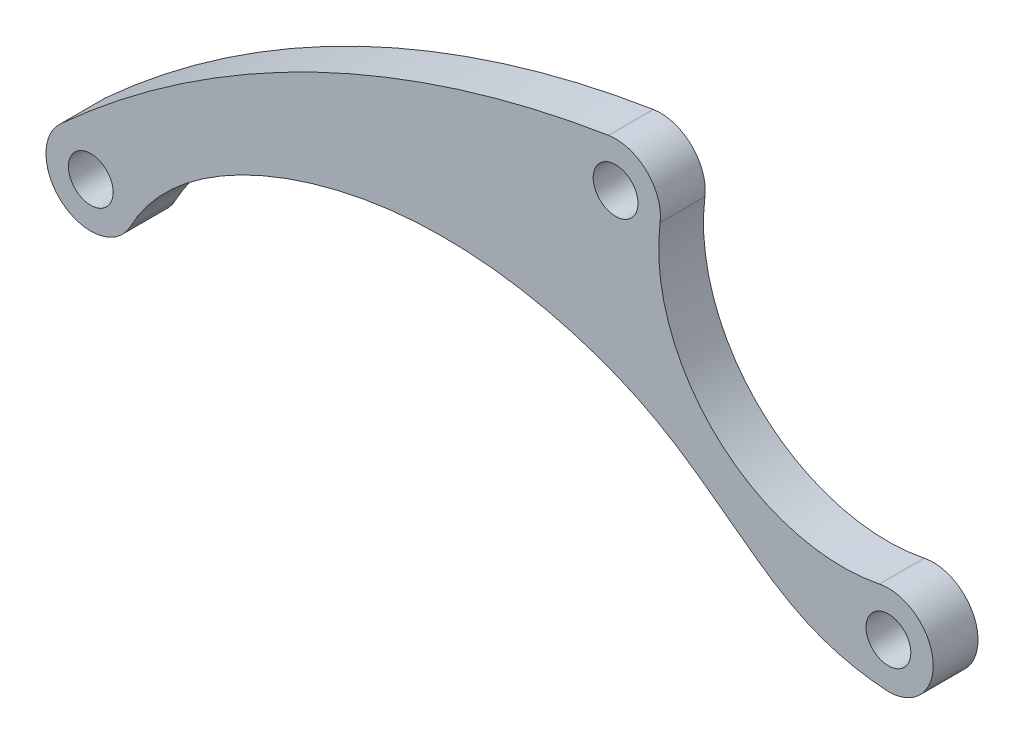
ISO-10303-21;
HEADER;
FILE_DESCRIPTION(('STEP AP214'),'2;1');
FILE_NAME('part.step','',(''),(''),'','','');
FILE_SCHEMA(('AUTOMOTIVE_DESIGN { 1 0 10303 214 1 1 1 1 }'));
ENDSEC;
DATA;
#1=APPLICATION_CONTEXT('core data for automotive mechanical design processes');
#2=APPLICATION_PROTOCOL_DEFINITION('international standard','automotive_design',2000,#1);
#3=PRODUCT_CONTEXT('',#1,'mechanical');
#4=PRODUCT('Part','Part','',(#3));
#5=PRODUCT_RELATED_PRODUCT_CATEGORY('part','',(#4));
#6=PRODUCT_DEFINITION_FORMATION('','',#4);
#7=PRODUCT_DEFINITION_CONTEXT('part definition',#1,'design');
#8=PRODUCT_DEFINITION('design','',#6,#7);
#9=PRODUCT_DEFINITION_SHAPE('','',#8);
#10=(LENGTH_UNIT() NAMED_UNIT(*) SI_UNIT(.MILLI.,.METRE.));
#11=(NAMED_UNIT(*) PLANE_ANGLE_UNIT() SI_UNIT($,.RADIAN.));
#12=(NAMED_UNIT(*) SI_UNIT($,.STERADIAN.) SOLID_ANGLE_UNIT());
#13=UNCERTAINTY_MEASURE_WITH_UNIT(LENGTH_MEASURE(1.E-05),#10,'distance_accuracy_value','');
#14=(GEOMETRIC_REPRESENTATION_CONTEXT(3) GLOBAL_UNCERTAINTY_ASSIGNED_CONTEXT((#13)) GLOBAL_UNIT_ASSIGNED_CONTEXT((#10,
#11,#12)) REPRESENTATION_CONTEXT('',''));
#15=CARTESIAN_POINT('',(0.,0.,0.));
#16=DIRECTION('',(0.,0.,1.));
#17=DIRECTION('',(1.,0.,0.));
#18=AXIS2_PLACEMENT_3D('',#15,#16,#17);
#19=CARTESIAN_POINT('',(63.322129308282,-56.5683404129136,2.5));
#20=DIRECTION('',(0.,0.,-1.));
#21=DIRECTION('',(-1.,0.,0.));
#22=AXIS2_PLACEMENT_3D('',#19,#20,#21);
#23=PLANE('',#22);
#24=CARTESIAN_POINT('',(0.,0.,2.5));
#25=DIRECTION('',(0.,0.,1.));
#26=DIRECTION('',(1.,0.,0.));
#27=AXIS2_PLACEMENT_3D('',#24,#25,#26);
#28=CIRCLE('',#27,2.5);
#29=CARTESIAN_POINT('',(2.5,0.,2.5));
#30=VERTEX_POINT('',#29);
#31=EDGE_CURVE('E174',#30,#30,#28,.T.);
#32=ORIENTED_EDGE('',*,*,#31,.F.);
#33=EDGE_LOOP('',(#32));
#34=FACE_BOUND('',#33,.T.);
#35=CARTESIAN_POINT('',(58.560393258427,28.2078063914651,2.5));
#36=DIRECTION('',(0.,0.,1.));
#37=DIRECTION('',(1.,0.,0.));
#38=AXIS2_PLACEMENT_3D('',#35,#36,#37);
#39=CIRCLE('',#38,2.5);
#40=CARTESIAN_POINT('',(61.060393258427,28.2078063914651,2.5));
#41=VERTEX_POINT('',#40);
#42=EDGE_CURVE('E180',#41,#41,#39,.T.);
#43=ORIENTED_EDGE('',*,*,#42,.F.);
#44=EDGE_LOOP('',(#43));
#45=FACE_BOUND('',#44,.T.);
#46=CARTESIAN_POINT('',(89.,0.,2.5));
#47=DIRECTION('',(0.,0.,1.));
#48=DIRECTION('',(1.,0.,0.));
#49=AXIS2_PLACEMENT_3D('',#46,#47,#48);
#50=CIRCLE('',#49,2.5);
#51=CARTESIAN_POINT('',(91.5,0.,2.5));
#52=VERTEX_POINT('',#51);
#53=EDGE_CURVE('E91',#52,#52,#50,.T.);
#54=ORIENTED_EDGE('',*,*,#53,.F.);
#55=EDGE_LOOP('',(#54));
#56=FACE_BOUND('',#55,.T.);
#57=CARTESIAN_POINT('',(83.9037094730714,25.0283879122591,2.5));
#58=DIRECTION('',(0.,0.,-1.));
#59=DIRECTION('',(1.,0.,0.));
#60=AXIS2_PLACEMENT_3D('',#57,#58,#59);
#61=CIRCLE('',#60,20.5419728803665);
#62=CARTESIAN_POINT('',(88.0023694428777,4.89946254924922,2.5));
#63=VERTEX_POINT('',#62);
#64=CARTESIAN_POINT('',(63.5215049809528,27.5854154559454,2.5));
#65=VERTEX_POINT('',#64);
#66=EDGE_CURVE('E106',#63,#65,#61,.T.);
#67=ORIENTED_EDGE('',*,*,#66,.T.);
#68=CARTESIAN_POINT('',(58.560393258427,28.2078063914651,2.5));
#69=DIRECTION('',(0.,0.,1.));
#70=DIRECTION('',(1.,0.,0.));
#71=AXIS2_PLACEMENT_3D('',#68,#69,#70);
#72=CIRCLE('',#71,4.99999999999999);
#73=CARTESIAN_POINT('',(57.7718587958262,33.145236229072,2.5));
#74=VERTEX_POINT('',#73);
#75=EDGE_CURVE('E42',#65,#74,#72,.T.);
#76=ORIENTED_EDGE('',*,*,#75,.T.);
#77=CARTESIAN_POINT('',(76.4532994800569,-83.8291092416137,2.5));
#78=DIRECTION('',(0.,0.,1.));
#79=DIRECTION('',(1.,0.,0.));
#80=AXIS2_PLACEMENT_3D('',#77,#78,#79);
#81=CIRCLE('',#80,118.45671667041);
#82=CARTESIAN_POINT('',(-3.36927163607918,3.69432113416149,2.5));
#83=VERTEX_POINT('',#82);
#84=EDGE_CURVE('E194',#74,#83,#81,.T.);
#85=ORIENTED_EDGE('',*,*,#84,.T.);
#86=CARTESIAN_POINT('',(0.,0.,2.5));
#87=DIRECTION('',(0.,0.,1.));
#88=DIRECTION('',(1.,0.,0.));
#89=AXIS2_PLACEMENT_3D('',#86,#87,#88);
#90=CIRCLE('',#89,4.99999999999999);
#91=CARTESIAN_POINT('',(4.42611780676406,-2.32582913401781,2.5));
#92=VERTEX_POINT('',#91);
#93=EDGE_CURVE('E95',#83,#92,#90,.T.);
#94=ORIENTED_EDGE('',*,*,#93,.T.);
#95=CARTESIAN_POINT('',(4.42611780676406,-2.32582913401781,2.5));
#96=CARTESIAN_POINT('',(8.33275267886313,5.10860614715566,2.5));
#97=CARTESIAN_POINT('',(26.8007329015041,15.2150761400881,2.5));
#98=CARTESIAN_POINT('',(48.7403378388762,14.4731406143159,2.5));
#99=CARTESIAN_POINT('',(64.3474183146082,8.19539651395072,2.5));
#100=CARTESIAN_POINT('',(74.8177204570148,-0.231553233666748,2.5));
#101=CARTESIAN_POINT('',(81.7848251557577,-4.53798812568066,2.5));
#102=CARTESIAN_POINT('',(89.,-4.99999999999999,2.5));
#103=B_SPLINE_CURVE_WITH_KNOTS('',3,(#95,#96,#97,#98,#99,#100,#101,#102),.UNSPECIFIED.,.F.,.F.,
(4,1,1,1,1,4),(0.,0.281768749318887,0.583331100659313,0.69081450670961,0.820319314759838,1.),.UNSPECIFIED.);
#104=CARTESIAN_POINT('',(89.,-4.99999999999999,2.5));
#105=VERTEX_POINT('',#104);
#106=EDGE_CURVE('E110',#92,#105,#103,.T.);
#107=ORIENTED_EDGE('',*,*,#106,.T.);
#108=CARTESIAN_POINT('',(89.,0.,2.5));
#109=DIRECTION('',(0.,0.,1.));
#110=DIRECTION('',(1.,0.,0.));
#111=AXIS2_PLACEMENT_3D('',#108,#109,#110);
#112=CIRCLE('',#111,4.99999999999999);
#113=EDGE_CURVE('E191',#105,#63,#112,.T.);
#114=ORIENTED_EDGE('',*,*,#113,.T.);
#115=EDGE_LOOP('',(#67,#76,#85,#94,#107,#114));
#116=FACE_BOUND('',#115,.T.);
#117=ADVANCED_FACE('F34',(#34,#45,#56,#116),#23,.F.);
#118=CARTESIAN_POINT('',(63.322129308282,-56.5683404129136,-2.5));
#119=DIRECTION('',(0.,0.,-1.));
#120=DIRECTION('',(-1.,0.,0.));
#121=AXIS2_PLACEMENT_3D('',#118,#119,#120);
#122=PLANE('',#121);
#123=CARTESIAN_POINT('',(58.560393258427,28.2078063914651,-2.5));
#124=DIRECTION('',(0.,0.,1.));
#125=DIRECTION('',(1.,0.,0.));
#126=AXIS2_PLACEMENT_3D('',#123,#124,#125);
#127=CIRCLE('',#126,2.5);
#128=CARTESIAN_POINT('',(61.060393258427,28.2078063914651,-2.5));
#129=VERTEX_POINT('',#128);
#130=EDGE_CURVE('E177',#129,#129,#127,.T.);
#131=ORIENTED_EDGE('',*,*,#130,.T.);
#132=EDGE_LOOP('',(#131));
#133=FACE_BOUND('',#132,.T.);
#134=CARTESIAN_POINT('',(89.,0.,-2.5));
#135=DIRECTION('',(0.,0.,1.));
#136=DIRECTION('',(1.,0.,0.));
#137=AXIS2_PLACEMENT_3D('',#134,#135,#136);
#138=CIRCLE('',#137,2.5);
#139=CARTESIAN_POINT('',(91.5,0.,-2.5));
#140=VERTEX_POINT('',#139);
#141=EDGE_CURVE('E183',#140,#140,#138,.T.);
#142=ORIENTED_EDGE('',*,*,#141,.T.);
#143=EDGE_LOOP('',(#142));
#144=FACE_BOUND('',#143,.T.);
#145=CARTESIAN_POINT('',(0.,0.,-2.5));
#146=DIRECTION('',(0.,0.,1.));
#147=DIRECTION('',(1.,0.,0.));
#148=AXIS2_PLACEMENT_3D('',#145,#146,#147);
#149=CIRCLE('',#148,2.5);
#150=CARTESIAN_POINT('',(2.5,0.,-2.5));
#151=VERTEX_POINT('',#150);
#152=EDGE_CURVE('E170',#151,#151,#149,.T.);
#153=ORIENTED_EDGE('',*,*,#152,.T.);
#154=EDGE_LOOP('',(#153));
#155=FACE_BOUND('',#154,.T.);
#156=CARTESIAN_POINT('',(58.560393258427,28.2078063914651,-2.5));
#157=DIRECTION('',(0.,0.,1.));
#158=DIRECTION('',(1.,0.,0.));
#159=AXIS2_PLACEMENT_3D('',#156,#157,#158);
#160=CIRCLE('',#159,4.99999999999999);
#161=CARTESIAN_POINT('',(63.5215049809528,27.5854154559454,-2.5));
#162=VERTEX_POINT('',#161);
#163=CARTESIAN_POINT('',(57.7718587958262,33.145236229072,-2.5));
#164=VERTEX_POINT('',#163);
#165=EDGE_CURVE('E161',#162,#164,#160,.T.);
#166=ORIENTED_EDGE('',*,*,#165,.F.);
#167=CARTESIAN_POINT('',(83.9037094730714,25.0283879122591,-2.5));
#168=DIRECTION('',(0.,0.,-1.));
#169=DIRECTION('',(1.,0.,0.));
#170=AXIS2_PLACEMENT_3D('',#167,#168,#169);
#171=CIRCLE('',#170,20.5419728803665);
#172=CARTESIAN_POINT('',(88.0023694428777,4.89946254924922,-2.5));
#173=VERTEX_POINT('',#172);
#174=EDGE_CURVE('E100',#173,#162,#171,.T.);
#175=ORIENTED_EDGE('',*,*,#174,.F.);
#176=CARTESIAN_POINT('',(89.,0.,-2.5));
#177=DIRECTION('',(0.,0.,1.));
#178=DIRECTION('',(1.,0.,0.));
#179=AXIS2_PLACEMENT_3D('',#176,#177,#178);
#180=CIRCLE('',#179,4.99999999999999);
#181=CARTESIAN_POINT('',(89.,-4.99999999999999,-2.5));
#182=VERTEX_POINT('',#181);
#183=EDGE_CURVE('E90',#182,#173,#180,.T.);
#184=ORIENTED_EDGE('',*,*,#183,.F.);
#185=CARTESIAN_POINT('',(4.42611780676406,-2.32582913401781,-2.5));
#186=CARTESIAN_POINT('',(8.33275267886313,5.10860614715566,-2.5));
#187=CARTESIAN_POINT('',(26.8007329015041,15.2150761400881,-2.5));
#188=CARTESIAN_POINT('',(48.7403378388762,14.4731406143159,-2.5));
#189=CARTESIAN_POINT('',(64.3474183146082,8.19539651395072,-2.5));
#190=CARTESIAN_POINT('',(74.8177204570148,-0.231553233666748,-2.5));
#191=CARTESIAN_POINT('',(81.7848251557577,-4.53798812568066,-2.5));
#192=CARTESIAN_POINT('',(89.,-4.99999999999999,-2.5));
#193=B_SPLINE_CURVE_WITH_KNOTS('',3,(#185,#186,#187,#188,#189,#190,#191,#192),.UNSPECIFIED.,.F.,
.F.,(4,1,1,1,1,4),(0.,0.281768749318887,0.583331100659313,0.69081450670961,0.820319314759838,
1.),.UNSPECIFIED.);
#194=CARTESIAN_POINT('',(4.42611780676406,-2.32582913401781,-2.5));
#195=VERTEX_POINT('',#194);
#196=EDGE_CURVE('E49',#195,#182,#193,.T.);
#197=ORIENTED_EDGE('',*,*,#196,.F.);
#198=CARTESIAN_POINT('',(0.,0.,-2.5));
#199=DIRECTION('',(0.,0.,1.));
#200=DIRECTION('',(1.,0.,0.));
#201=AXIS2_PLACEMENT_3D('',#198,#199,#200);
#202=CIRCLE('',#201,4.99999999999999);
#203=CARTESIAN_POINT('',(-3.36927163607918,3.69432113416149,-2.5));
#204=VERTEX_POINT('',#203);
#205=EDGE_CURVE('E56',#204,#195,#202,.T.);
#206=ORIENTED_EDGE('',*,*,#205,.F.);
#207=CARTESIAN_POINT('',(76.4532994800569,-83.8291092416137,-2.5));
#208=DIRECTION('',(0.,0.,1.));
#209=DIRECTION('',(1.,0.,0.));
#210=AXIS2_PLACEMENT_3D('',#207,#208,#209);
#211=CIRCLE('',#210,118.45671667041);
#212=EDGE_CURVE('E88',#164,#204,#211,.T.);
#213=ORIENTED_EDGE('',*,*,#212,.F.);
#214=EDGE_LOOP('',(#166,#175,#184,#197,#206,#213));
#215=FACE_BOUND('',#214,.T.);
#216=ADVANCED_FACE('F86',(#133,#144,#155,#215),#122,.T.);
#217=CARTESIAN_POINT('',(0.,0.,2.5));
#218=DIRECTION('',(0.,0.,-1.));
#219=DIRECTION('',(-1.,0.,0.));
#220=AXIS2_PLACEMENT_3D('',#217,#218,#219);
#221=CYLINDRICAL_SURFACE('',#220,4.99999999999999);
#222=ORIENTED_EDGE('',*,*,#205,.T.);
#223=DIRECTION('',(0.,0.,1.));
#224=VECTOR('',#223,1.);
#225=CARTESIAN_POINT('',(4.42611780676406,-2.32582913401781,-2.5));
#226=LINE('',#225,#224);
#227=EDGE_CURVE('E99',#195,#92,#226,.T.);
#228=ORIENTED_EDGE('',*,*,#227,.T.);
#229=ORIENTED_EDGE('',*,*,#93,.F.);
#230=DIRECTION('',(0.,0.,1.));
#231=VECTOR('',#230,1.);
#232=CARTESIAN_POINT('',(-3.36927163607918,3.69432113416149,-2.5));
#233=LINE('',#232,#231);
#234=EDGE_CURVE('E94',#204,#83,#233,.T.);
#235=ORIENTED_EDGE('',*,*,#234,.F.);
#236=EDGE_LOOP('',(#222,#228,#229,#235));
#237=FACE_BOUND('',#236,.T.);
#238=ADVANCED_FACE('F36',(#237),#221,.T.);
#239=CARTESIAN_POINT('',(89.,0.,2.5));
#240=DIRECTION('',(0.,0.,-1.));
#241=DIRECTION('',(-1.,0.,0.));
#242=AXIS2_PLACEMENT_3D('',#239,#240,#241);
#243=CYLINDRICAL_SURFACE('',#242,4.99999999999999);
#244=ORIENTED_EDGE('',*,*,#183,.T.);
#245=DIRECTION('',(0.,0.,1.));
#246=VECTOR('',#245,1.);
#247=CARTESIAN_POINT('',(88.0023694428777,4.89946254924922,-2.5));
#248=LINE('',#247,#246);
#249=EDGE_CURVE('E158',#173,#63,#248,.T.);
#250=ORIENTED_EDGE('',*,*,#249,.T.);
#251=ORIENTED_EDGE('',*,*,#113,.F.);
#252=DIRECTION('',(0.,0.,-1.));
#253=VECTOR('',#252,1.);
#254=CARTESIAN_POINT('',(89.,-4.99999999999999,2.5));
#255=LINE('',#254,#253);
#256=EDGE_CURVE('E12',#105,#182,#255,.T.);
#257=ORIENTED_EDGE('',*,*,#256,.T.);
#258=EDGE_LOOP('',(#244,#250,#251,#257));
#259=FACE_BOUND('',#258,.T.);
#260=ADVANCED_FACE('F148',(#259),#243,.T.);
#261=CARTESIAN_POINT('',(58.560393258427,28.2078063914651,2.5));
#262=DIRECTION('',(0.,0.,-1.));
#263=DIRECTION('',(-1.,0.,0.));
#264=AXIS2_PLACEMENT_3D('',#261,#262,#263);
#265=CYLINDRICAL_SURFACE('',#264,4.99999999999999);
#266=ORIENTED_EDGE('',*,*,#165,.T.);
#267=DIRECTION('',(0.,0.,1.));
#268=VECTOR('',#267,1.);
#269=CARTESIAN_POINT('',(57.7718587958262,33.145236229072,-2.5));
#270=LINE('',#269,#268);
#271=EDGE_CURVE('E105',#164,#74,#270,.T.);
#272=ORIENTED_EDGE('',*,*,#271,.T.);
#273=ORIENTED_EDGE('',*,*,#75,.F.);
#274=DIRECTION('',(0.,0.,1.));
#275=VECTOR('',#274,1.);
#276=CARTESIAN_POINT('',(63.5215049809528,27.5854154559454,-2.5));
#277=LINE('',#276,#275);
#278=EDGE_CURVE('E166',#162,#65,#277,.T.);
#279=ORIENTED_EDGE('',*,*,#278,.F.);
#280=EDGE_LOOP('',(#266,#272,#273,#279));
#281=FACE_BOUND('',#280,.T.);
#282=ADVANCED_FACE('F139',(#281),#265,.T.);
#283=CARTESIAN_POINT('',(89.,0.,2.5));
#284=DIRECTION('',(0.,0.,-1.));
#285=DIRECTION('',(-1.,0.,0.));
#286=AXIS2_PLACEMENT_3D('',#283,#284,#285);
#287=CYLINDRICAL_SURFACE('',#286,2.5);
#288=ORIENTED_EDGE('',*,*,#53,.T.);
#289=EDGE_LOOP('',(#288));
#290=FACE_BOUND('',#289,.T.);
#291=ORIENTED_EDGE('',*,*,#141,.F.);
#292=EDGE_LOOP('',(#291));
#293=FACE_BOUND('',#292,.T.);
#294=ADVANCED_FACE('F135',(#290,#293),#287,.F.);
#295=CARTESIAN_POINT('',(58.560393258427,28.2078063914651,2.5));
#296=DIRECTION('',(0.,0.,-1.));
#297=DIRECTION('',(-1.,0.,0.));
#298=AXIS2_PLACEMENT_3D('',#295,#296,#297);
#299=CYLINDRICAL_SURFACE('',#298,2.5);
#300=ORIENTED_EDGE('',*,*,#42,.T.);
#301=EDGE_LOOP('',(#300));
#302=FACE_BOUND('',#301,.T.);
#303=ORIENTED_EDGE('',*,*,#130,.F.);
#304=EDGE_LOOP('',(#303));
#305=FACE_BOUND('',#304,.T.);
#306=ADVANCED_FACE('F131',(#302,#305),#299,.F.);
#307=CARTESIAN_POINT('',(0.,0.,2.5));
#308=DIRECTION('',(0.,0.,-1.));
#309=DIRECTION('',(-1.,0.,0.));
#310=AXIS2_PLACEMENT_3D('',#307,#308,#309);
#311=CYLINDRICAL_SURFACE('',#310,2.5);
#312=ORIENTED_EDGE('',*,*,#31,.T.);
#313=EDGE_LOOP('',(#312));
#314=FACE_BOUND('',#313,.T.);
#315=ORIENTED_EDGE('',*,*,#152,.F.);
#316=EDGE_LOOP('',(#315));
#317=FACE_BOUND('',#316,.T.);
#318=ADVANCED_FACE('F128',(#314,#317),#311,.F.);
#319=CARTESIAN_POINT('',(83.9037094730714,25.0283879122591,-2.5));
#320=DIRECTION('',(0.,0.,1.));
#321=DIRECTION('',(1.,0.,0.));
#322=AXIS2_PLACEMENT_3D('',#319,#320,#321);
#323=CYLINDRICAL_SURFACE('',#322,20.5419728803665);
#324=ORIENTED_EDGE('',*,*,#66,.F.);
#325=ORIENTED_EDGE('',*,*,#249,.F.);
#326=ORIENTED_EDGE('',*,*,#174,.T.);
#327=ORIENTED_EDGE('',*,*,#278,.T.);
#328=EDGE_LOOP('',(#324,#325,#326,#327));
#329=FACE_BOUND('',#328,.T.);
#330=ADVANCED_FACE('F125',(#329),#323,.F.);
#331=DIRECTION('',(0.,0.,1.));
#332=VECTOR('',#331,1.);
#333=SURFACE_OF_LINEAR_EXTRUSION('',#193,#332);
#334=ORIENTED_EDGE('',*,*,#106,.F.);
#335=ORIENTED_EDGE('',*,*,#227,.F.);
#336=ORIENTED_EDGE('',*,*,#196,.T.);
#337=ORIENTED_EDGE('',*,*,#256,.F.);
#338=EDGE_LOOP('',(#334,#335,#336,#337));
#339=FACE_BOUND('',#338,.T.);
#340=ADVANCED_FACE('F121',(#339),#333,.T.);
#341=CARTESIAN_POINT('',(76.4532994800569,-83.8291092416137,-2.5));
#342=DIRECTION('',(0.,0.,1.));
#343=DIRECTION('',(1.,0.,0.));
#344=AXIS2_PLACEMENT_3D('',#341,#342,#343);
#345=CYLINDRICAL_SURFACE('',#344,118.45671667041);
#346=ORIENTED_EDGE('',*,*,#84,.F.);
#347=ORIENTED_EDGE('',*,*,#271,.F.);
#348=ORIENTED_EDGE('',*,*,#212,.T.);
#349=ORIENTED_EDGE('',*,*,#234,.T.);
#350=EDGE_LOOP('',(#346,#347,#348,#349));
#351=FACE_BOUND('',#350,.T.);
#352=ADVANCED_FACE('F103',(#351),#345,.T.);
#353=CLOSED_SHELL('',(#117,#216,#238,#260,#282,#294,#306,#318,#330,#340,#352));
#354=MANIFOLD_SOLID_BREP('B2',#353);
#355=ADVANCED_BREP_SHAPE_REPRESENTATION('',(#18,#354),#14);
#356=SHAPE_DEFINITION_REPRESENTATION(#9,#355);
ENDSEC;
END-ISO-10303-21;
